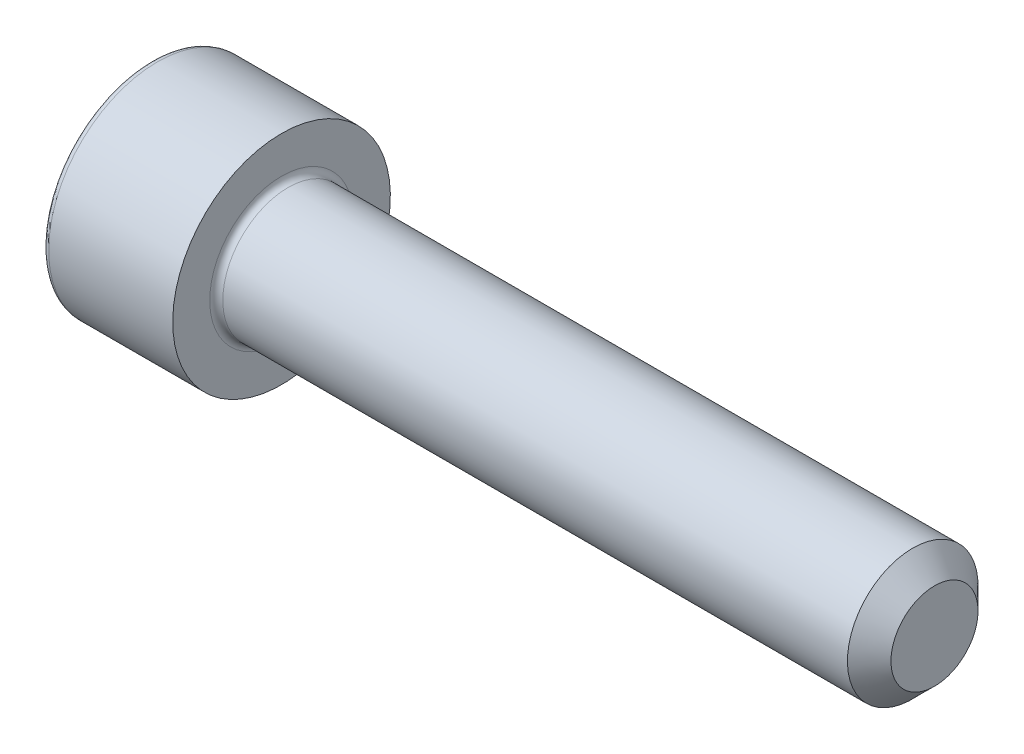
ISO-10303-21;
HEADER;
FILE_DESCRIPTION(('STEP AP214'),'2;1');
FILE_NAME('part.step','',(''),(''),'','','');
FILE_SCHEMA(('AUTOMOTIVE_DESIGN { 1 0 10303 214 1 1 1 1 }'));
ENDSEC;
DATA;
#1=APPLICATION_CONTEXT('core data for automotive mechanical design processes');
#2=APPLICATION_PROTOCOL_DEFINITION('international standard','automotive_design',2000,#1);
#3=PRODUCT_CONTEXT('',#1,'mechanical');
#4=PRODUCT('Part','Part','',(#3));
#5=PRODUCT_RELATED_PRODUCT_CATEGORY('part','',(#4));
#6=PRODUCT_DEFINITION_FORMATION('','',#4);
#7=PRODUCT_DEFINITION_CONTEXT('part definition',#1,'design');
#8=PRODUCT_DEFINITION('design','',#6,#7);
#9=PRODUCT_DEFINITION_SHAPE('','',#8);
#10=(LENGTH_UNIT() NAMED_UNIT(*) SI_UNIT(.MILLI.,.METRE.));
#11=(NAMED_UNIT(*) PLANE_ANGLE_UNIT() SI_UNIT($,.RADIAN.));
#12=(NAMED_UNIT(*) SI_UNIT($,.STERADIAN.) SOLID_ANGLE_UNIT());
#13=UNCERTAINTY_MEASURE_WITH_UNIT(LENGTH_MEASURE(1.E-05),#10,'distance_accuracy_value','');
#14=(GEOMETRIC_REPRESENTATION_CONTEXT(3) GLOBAL_UNCERTAINTY_ASSIGNED_CONTEXT((#13)) GLOBAL_UNIT_ASSIGNED_CONTEXT((#10,
#11,#12)) REPRESENTATION_CONTEXT('',''));
#15=CARTESIAN_POINT('',(0.,0.,0.));
#16=DIRECTION('',(0.,0.,1.));
#17=DIRECTION('',(1.,0.,0.));
#18=AXIS2_PLACEMENT_3D('',#15,#16,#17);
#19=CARTESIAN_POINT('',(0.,0.,0.));
#20=DIRECTION('',(-1.,0.,0.));
#21=DIRECTION('',(0.,-1.,0.));
#22=AXIS2_PLACEMENT_3D('',#19,#20,#21);
#23=PLANE('',#22);
#24=CARTESIAN_POINT('',(0.,0.,0.));
#25=DIRECTION('',(-1.,0.,0.));
#26=DIRECTION('',(0.,-1.,0.));
#27=AXIS2_PLACEMENT_3D('',#24,#25,#26);
#28=CIRCLE('',#27,4.7);
#29=CARTESIAN_POINT('',(0.,-4.7,0.));
#30=VERTEX_POINT('',#29);
#31=EDGE_CURVE('E158',#30,#30,#28,.T.);
#32=ORIENTED_EDGE('',*,*,#31,.T.);
#33=EDGE_LOOP('',(#32));
#34=FACE_BOUND('',#33,.T.);
#35=DIRECTION('',(0.,0.,-1.));
#36=VECTOR('',#35,1.);
#37=CARTESIAN_POINT('',(0.,2.5,1.44337567297407));
#38=LINE('',#37,#36);
#39=CARTESIAN_POINT('',(0.,2.5,1.44337567297407));
#40=VERTEX_POINT('',#39);
#41=CARTESIAN_POINT('',(0.,2.5,-1.44337567297406));
#42=VERTEX_POINT('',#41);
#43=EDGE_CURVE('E54',#40,#42,#38,.T.);
#44=ORIENTED_EDGE('',*,*,#43,.F.);
#45=DIRECTION('',(0.,0.866025403784439,-0.5));
#46=VECTOR('',#45,1.);
#47=CARTESIAN_POINT('',(0.,0.,2.88675134594813));
#48=LINE('',#47,#46);
#49=CARTESIAN_POINT('',(0.,0.,2.88675134594813));
#50=VERTEX_POINT('',#49);
#51=EDGE_CURVE('E137',#50,#40,#48,.T.);
#52=ORIENTED_EDGE('',*,*,#51,.F.);
#53=DIRECTION('',(0.,0.866025403784439,0.5));
#54=VECTOR('',#53,1.);
#55=CARTESIAN_POINT('',(0.,-2.5,1.44337567297406));
#56=LINE('',#55,#54);
#57=CARTESIAN_POINT('',(0.,-2.5,1.44337567297406));
#58=VERTEX_POINT('',#57);
#59=EDGE_CURVE('E135',#58,#50,#56,.T.);
#60=ORIENTED_EDGE('',*,*,#59,.F.);
#61=DIRECTION('',(0.,0.,1.));
#62=VECTOR('',#61,1.);
#63=CARTESIAN_POINT('',(0.,-2.5,-1.44337567297407));
#64=LINE('',#63,#62);
#65=CARTESIAN_POINT('',(0.,-2.5,-1.44337567297407));
#66=VERTEX_POINT('',#65);
#67=EDGE_CURVE('E102',#66,#58,#64,.T.);
#68=ORIENTED_EDGE('',*,*,#67,.F.);
#69=DIRECTION('',(0.,-0.866025403784439,0.5));
#70=VECTOR('',#69,1.);
#71=CARTESIAN_POINT('',(0.,0.,-2.88675134594813));
#72=LINE('',#71,#70);
#73=CARTESIAN_POINT('',(0.,0.,-2.88675134594813));
#74=VERTEX_POINT('',#73);
#75=EDGE_CURVE('E131',#74,#66,#72,.T.);
#76=ORIENTED_EDGE('',*,*,#75,.F.);
#77=DIRECTION('',(0.,-0.866025403784439,-0.5));
#78=VECTOR('',#77,1.);
#79=CARTESIAN_POINT('',(0.,2.5,-1.44337567297406));
#80=LINE('',#79,#78);
#81=EDGE_CURVE('E128',#42,#74,#80,.T.);
#82=ORIENTED_EDGE('',*,*,#81,.F.);
#83=EDGE_LOOP('',(#44,#52,#60,#68,#76,#82));
#84=FACE_BOUND('',#83,.T.);
#85=ADVANCED_FACE('F38',(#34,#84),#23,.T.);
#86=CARTESIAN_POINT('',(36.,0.,0.));
#87=DIRECTION('',(1.,0.,0.));
#88=DIRECTION('',(0.,1.,0.));
#89=AXIS2_PLACEMENT_3D('',#86,#87,#88);
#90=CYLINDRICAL_SURFACE('',#89,5.);
#91=CARTESIAN_POINT('',(0.300000000000002,0.,0.));
#92=DIRECTION('',(-1.,0.,0.));
#93=DIRECTION('',(0.,-1.,0.));
#94=AXIS2_PLACEMENT_3D('',#91,#92,#93);
#95=CIRCLE('',#94,5.);
#96=CARTESIAN_POINT('',(0.300000000000002,-5.,0.));
#97=VERTEX_POINT('',#96);
#98=EDGE_CURVE('E155',#97,#97,#95,.F.);
#99=ORIENTED_EDGE('',*,*,#98,.T.);
#100=EDGE_LOOP('',(#99));
#101=FACE_BOUND('',#100,.T.);
#102=CARTESIAN_POINT('',(6.,0.,0.));
#103=DIRECTION('',(1.,0.,0.));
#104=DIRECTION('',(0.,1.,0.));
#105=AXIS2_PLACEMENT_3D('',#102,#103,#104);
#106=CIRCLE('',#105,5.);
#107=CARTESIAN_POINT('',(6.,5.,0.));
#108=VERTEX_POINT('',#107);
#109=EDGE_CURVE('E141',#108,#108,#106,.T.);
#110=ORIENTED_EDGE('',*,*,#109,.F.);
#111=EDGE_LOOP('',(#110));
#112=FACE_BOUND('',#111,.T.);
#113=ADVANCED_FACE('F175',(#101,#112),#90,.T.);
#114=CARTESIAN_POINT('',(6.,5.,0.));
#115=DIRECTION('',(1.,0.,0.));
#116=DIRECTION('',(0.,1.,0.));
#117=AXIS2_PLACEMENT_3D('',#114,#115,#116);
#118=PLANE('',#117);
#119=CARTESIAN_POINT('',(6.,0.,0.));
#120=DIRECTION('',(1.,0.,0.));
#121=DIRECTION('',(0.,1.,0.));
#122=AXIS2_PLACEMENT_3D('',#119,#120,#121);
#123=CIRCLE('',#122,3.29999999999999);
#124=CARTESIAN_POINT('',(6.,3.29999999999999,0.));
#125=VERTEX_POINT('',#124);
#126=EDGE_CURVE('E152',#125,#125,#123,.F.);
#127=ORIENTED_EDGE('',*,*,#126,.T.);
#128=EDGE_LOOP('',(#127));
#129=FACE_BOUND('',#128,.T.);
#130=ORIENTED_EDGE('',*,*,#109,.T.);
#131=EDGE_LOOP('',(#130));
#132=FACE_BOUND('',#131,.T.);
#133=ADVANCED_FACE('F181',(#129,#132),#118,.T.);
#134=CARTESIAN_POINT('',(36.,0.,0.));
#135=DIRECTION('',(1.,0.,0.));
#136=DIRECTION('',(0.,1.,0.));
#137=AXIS2_PLACEMENT_3D('',#134,#135,#136);
#138=CYLINDRICAL_SURFACE('',#137,2.99999999999999);
#139=CARTESIAN_POINT('',(35.,0.,0.));
#140=DIRECTION('',(1.,0.,0.));
#141=DIRECTION('',(0.,1.,0.));
#142=AXIS2_PLACEMENT_3D('',#139,#140,#141);
#143=CIRCLE('',#142,2.99999999999999);
#144=CARTESIAN_POINT('',(35.,3.,0.));
#145=VERTEX_POINT('',#144);
#146=EDGE_CURVE('E11',#145,#145,#143,.F.);
#147=ORIENTED_EDGE('',*,*,#146,.T.);
#148=EDGE_LOOP('',(#147));
#149=FACE_BOUND('',#148,.T.);
#150=CARTESIAN_POINT('',(6.3,0.,0.));
#151=DIRECTION('',(1.,0.,0.));
#152=DIRECTION('',(0.,1.,0.));
#153=AXIS2_PLACEMENT_3D('',#150,#151,#152);
#154=CIRCLE('',#153,2.99999999999999);
#155=CARTESIAN_POINT('',(6.3,2.99999999999999,0.));
#156=VERTEX_POINT('',#155);
#157=EDGE_CURVE('E149',#156,#156,#154,.T.);
#158=ORIENTED_EDGE('',*,*,#157,.T.);
#159=EDGE_LOOP('',(#158));
#160=FACE_BOUND('',#159,.T.);
#161=ADVANCED_FACE('F198',(#149,#160),#138,.T.);
#162=CARTESIAN_POINT('',(36.,3.,0.));
#163=DIRECTION('',(1.,0.,0.));
#164=DIRECTION('',(0.,1.,0.));
#165=AXIS2_PLACEMENT_3D('',#162,#163,#164);
#166=PLANE('',#165);
#167=CARTESIAN_POINT('',(36.,0.,0.));
#168=DIRECTION('',(1.,0.,0.));
#169=DIRECTION('',(0.,1.,0.));
#170=AXIS2_PLACEMENT_3D('',#167,#168,#169);
#171=CIRCLE('',#170,2.);
#172=CARTESIAN_POINT('',(36.,2.,0.));
#173=VERTEX_POINT('',#172);
#174=EDGE_CURVE('E47',#173,#173,#171,.T.);
#175=ORIENTED_EDGE('',*,*,#174,.T.);
#176=EDGE_LOOP('',(#175));
#177=FACE_BOUND('',#176,.T.);
#178=ADVANCED_FACE('F163',(#177),#166,.T.);
#179=CARTESIAN_POINT('',(2.5,2.5,1.44337567297407));
#180=DIRECTION('',(0.,1.,0.));
#181=DIRECTION('',(-1.,0.,0.));
#182=AXIS2_PLACEMENT_3D('',#179,#180,#181);
#183=PLANE('',#182);
#184=ORIENTED_EDGE('',*,*,#43,.T.);
#185=DIRECTION('',(-1.,0.,0.));
#186=VECTOR('',#185,1.);
#187=CARTESIAN_POINT('',(2.5,2.5,-1.44337567297406));
#188=LINE('',#187,#186);
#189=CARTESIAN_POINT('',(2.5,2.5,-1.44337567297406));
#190=VERTEX_POINT('',#189);
#191=EDGE_CURVE('E84',#190,#42,#188,.T.);
#192=ORIENTED_EDGE('',*,*,#191,.F.);
#193=DIRECTION('',(0.,0.,-1.));
#194=VECTOR('',#193,1.);
#195=CARTESIAN_POINT('',(2.5,2.5,1.44337567297407));
#196=LINE('',#195,#194);
#197=CARTESIAN_POINT('',(2.5,2.5,1.44337567297407));
#198=VERTEX_POINT('',#197);
#199=EDGE_CURVE('E139',#198,#190,#196,.T.);
#200=ORIENTED_EDGE('',*,*,#199,.F.);
#201=DIRECTION('',(-1.,0.,0.));
#202=VECTOR('',#201,1.);
#203=CARTESIAN_POINT('',(2.5,2.5,1.44337567297407));
#204=LINE('',#203,#202);
#205=EDGE_CURVE('E62',#198,#40,#204,.T.);
#206=ORIENTED_EDGE('',*,*,#205,.T.);
#207=EDGE_LOOP('',(#184,#192,#200,#206));
#208=FACE_BOUND('',#207,.T.);
#209=ADVANCED_FACE('F206',(#208),#183,.F.);
#210=CARTESIAN_POINT('',(2.5,0.,2.88675134594813));
#211=DIRECTION('',(0.,0.5,0.866025403784439));
#212=DIRECTION('',(0.,-0.866025403784439,0.5));
#213=AXIS2_PLACEMENT_3D('',#210,#211,#212);
#214=PLANE('',#213);
#215=ORIENTED_EDGE('',*,*,#51,.T.);
#216=ORIENTED_EDGE('',*,*,#205,.F.);
#217=DIRECTION('',(0.,0.866025403784439,-0.5));
#218=VECTOR('',#217,1.);
#219=CARTESIAN_POINT('',(2.5,0.,2.88675134594813));
#220=LINE('',#219,#218);
#221=CARTESIAN_POINT('',(2.5,0.,2.88675134594813));
#222=VERTEX_POINT('',#221);
#223=EDGE_CURVE('E114',#222,#198,#220,.T.);
#224=ORIENTED_EDGE('',*,*,#223,.F.);
#225=DIRECTION('',(-1.,0.,0.));
#226=VECTOR('',#225,1.);
#227=CARTESIAN_POINT('',(2.5,0.,2.88675134594813));
#228=LINE('',#227,#226);
#229=EDGE_CURVE('E106',#222,#50,#228,.T.);
#230=ORIENTED_EDGE('',*,*,#229,.T.);
#231=EDGE_LOOP('',(#215,#216,#224,#230));
#232=FACE_BOUND('',#231,.T.);
#233=ADVANCED_FACE('F212',(#232),#214,.F.);
#234=CARTESIAN_POINT('',(2.5,-2.5,1.44337567297406));
#235=DIRECTION('',(0.,-0.5,0.866025403784439));
#236=DIRECTION('',(0.,-0.866025403784439,-0.5));
#237=AXIS2_PLACEMENT_3D('',#234,#235,#236);
#238=PLANE('',#237);
#239=ORIENTED_EDGE('',*,*,#59,.T.);
#240=ORIENTED_EDGE('',*,*,#229,.F.);
#241=DIRECTION('',(0.,0.866025403784439,0.5));
#242=VECTOR('',#241,1.);
#243=CARTESIAN_POINT('',(2.5,-2.5,1.44337567297406));
#244=LINE('',#243,#242);
#245=CARTESIAN_POINT('',(2.5,-2.5,1.44337567297406));
#246=VERTEX_POINT('',#245);
#247=EDGE_CURVE('E110',#246,#222,#244,.T.);
#248=ORIENTED_EDGE('',*,*,#247,.F.);
#249=DIRECTION('',(-1.,0.,0.));
#250=VECTOR('',#249,1.);
#251=CARTESIAN_POINT('',(2.5,-2.5,1.44337567297406));
#252=LINE('',#251,#250);
#253=EDGE_CURVE('E95',#246,#58,#252,.T.);
#254=ORIENTED_EDGE('',*,*,#253,.T.);
#255=EDGE_LOOP('',(#239,#240,#248,#254));
#256=FACE_BOUND('',#255,.T.);
#257=ADVANCED_FACE('F111',(#256),#238,.F.);
#258=CARTESIAN_POINT('',(2.5,-2.5,-1.44337567297407));
#259=DIRECTION('',(0.,-1.,0.));
#260=DIRECTION('',(1.,0.,0.));
#261=AXIS2_PLACEMENT_3D('',#258,#259,#260);
#262=PLANE('',#261);
#263=ORIENTED_EDGE('',*,*,#67,.T.);
#264=ORIENTED_EDGE('',*,*,#253,.F.);
#265=DIRECTION('',(0.,0.,1.));
#266=VECTOR('',#265,1.);
#267=CARTESIAN_POINT('',(2.5,-2.5,-1.44337567297407));
#268=LINE('',#267,#266);
#269=CARTESIAN_POINT('',(2.5,-2.5,-1.44337567297407));
#270=VERTEX_POINT('',#269);
#271=EDGE_CURVE('E99',#270,#246,#268,.T.);
#272=ORIENTED_EDGE('',*,*,#271,.F.);
#273=DIRECTION('',(-1.,0.,0.));
#274=VECTOR('',#273,1.);
#275=CARTESIAN_POINT('',(2.5,-2.5,-1.44337567297407));
#276=LINE('',#275,#274);
#277=EDGE_CURVE('E107',#270,#66,#276,.T.);
#278=ORIENTED_EDGE('',*,*,#277,.T.);
#279=EDGE_LOOP('',(#263,#264,#272,#278));
#280=FACE_BOUND('',#279,.T.);
#281=ADVANCED_FACE('F97',(#280),#262,.F.);
#282=CARTESIAN_POINT('',(2.5,0.,-2.88675134594813));
#283=DIRECTION('',(0.,-0.5,-0.866025403784439));
#284=DIRECTION('',(0.,0.866025403784439,-0.5));
#285=AXIS2_PLACEMENT_3D('',#282,#283,#284);
#286=PLANE('',#285);
#287=ORIENTED_EDGE('',*,*,#75,.T.);
#288=ORIENTED_EDGE('',*,*,#277,.F.);
#289=DIRECTION('',(0.,-0.866025403784439,0.5));
#290=VECTOR('',#289,1.);
#291=CARTESIAN_POINT('',(2.5,0.,-2.88675134594813));
#292=LINE('',#291,#290);
#293=CARTESIAN_POINT('',(2.5,0.,-2.88675134594813));
#294=VERTEX_POINT('',#293);
#295=EDGE_CURVE('E120',#294,#270,#292,.T.);
#296=ORIENTED_EDGE('',*,*,#295,.F.);
#297=DIRECTION('',(-1.,0.,0.));
#298=VECTOR('',#297,1.);
#299=CARTESIAN_POINT('',(2.5,0.,-2.88675134594813));
#300=LINE('',#299,#298);
#301=EDGE_CURVE('E144',#294,#74,#300,.T.);
#302=ORIENTED_EDGE('',*,*,#301,.T.);
#303=EDGE_LOOP('',(#287,#288,#296,#302));
#304=FACE_BOUND('',#303,.T.);
#305=ADVANCED_FACE('F215',(#304),#286,.F.);
#306=CARTESIAN_POINT('',(2.5,2.5,-1.44337567297406));
#307=DIRECTION('',(0.,0.5,-0.866025403784439));
#308=DIRECTION('',(0.,0.866025403784439,0.5));
#309=AXIS2_PLACEMENT_3D('',#306,#307,#308);
#310=PLANE('',#309);
#311=ORIENTED_EDGE('',*,*,#81,.T.);
#312=ORIENTED_EDGE('',*,*,#301,.F.);
#313=DIRECTION('',(0.,-0.866025403784439,-0.5));
#314=VECTOR('',#313,1.);
#315=CARTESIAN_POINT('',(2.5,2.5,-1.44337567297406));
#316=LINE('',#315,#314);
#317=EDGE_CURVE('E122',#190,#294,#316,.T.);
#318=ORIENTED_EDGE('',*,*,#317,.F.);
#319=ORIENTED_EDGE('',*,*,#191,.T.);
#320=EDGE_LOOP('',(#311,#312,#318,#319));
#321=FACE_BOUND('',#320,.T.);
#322=ADVANCED_FACE('F192',(#321),#310,.F.);
#323=CARTESIAN_POINT('',(2.5,0.,0.));
#324=DIRECTION('',(-1.,0.,0.));
#325=DIRECTION('',(0.,-1.,0.));
#326=AXIS2_PLACEMENT_3D('',#323,#324,#325);
#327=PLANE('',#326);
#328=ORIENTED_EDGE('',*,*,#199,.T.);
#329=ORIENTED_EDGE('',*,*,#317,.T.);
#330=ORIENTED_EDGE('',*,*,#295,.T.);
#331=ORIENTED_EDGE('',*,*,#271,.T.);
#332=ORIENTED_EDGE('',*,*,#247,.T.);
#333=ORIENTED_EDGE('',*,*,#223,.T.);
#334=EDGE_LOOP('',(#328,#329,#330,#331,#332,#333));
#335=FACE_BOUND('',#334,.T.);
#336=ADVANCED_FACE('F117',(#335),#327,.T.);
#337=CARTESIAN_POINT('',(6.3,0.,0.));
#338=DIRECTION('',(1.,0.,0.));
#339=DIRECTION('',(0.,1.,0.));
#340=AXIS2_PLACEMENT_3D('',#337,#338,#339);
#341=TOROIDAL_SURFACE('',#340,3.29999999999999,0.3);
#342=ORIENTED_EDGE('',*,*,#126,.F.);
#343=EDGE_LOOP('',(#342));
#344=FACE_BOUND('',#343,.T.);
#345=ORIENTED_EDGE('',*,*,#157,.F.);
#346=EDGE_LOOP('',(#345));
#347=FACE_BOUND('',#346,.T.);
#348=ADVANCED_FACE('F171',(#344,#347),#341,.F.);
#349=CARTESIAN_POINT('',(0.300000000000002,0.,0.));
#350=DIRECTION('',(-1.,0.,0.));
#351=DIRECTION('',(0.,-1.,0.));
#352=AXIS2_PLACEMENT_3D('',#349,#350,#351);
#353=TOROIDAL_SURFACE('',#352,4.7,0.3);
#354=ORIENTED_EDGE('',*,*,#31,.F.);
#355=EDGE_LOOP('',(#354));
#356=FACE_BOUND('',#355,.T.);
#357=ORIENTED_EDGE('',*,*,#98,.F.);
#358=EDGE_LOOP('',(#357));
#359=FACE_BOUND('',#358,.T.);
#360=ADVANCED_FACE('F166',(#356,#359),#353,.T.);
#361=CARTESIAN_POINT('',(36.,0.,0.));
#362=DIRECTION('',(-1.,0.,0.));
#363=DIRECTION('',(0.,-1.,0.));
#364=AXIS2_PLACEMENT_3D('',#361,#362,#363);
#365=CONICAL_SURFACE('',#364,2.,0.785398163397453);
#366=ORIENTED_EDGE('',*,*,#146,.F.);
#367=EDGE_LOOP('',(#366));
#368=FACE_BOUND('',#367,.T.);
#369=ORIENTED_EDGE('',*,*,#174,.F.);
#370=EDGE_LOOP('',(#369));
#371=FACE_BOUND('',#370,.T.);
#372=ADVANCED_FACE('F41',(#368,#371),#365,.T.);
#373=CLOSED_SHELL('',(#85,#113,#133,#161,#178,#209,#233,#257,#281,#305,#322,#336,#348,#360,#372));
#374=MANIFOLD_SOLID_BREP('B2',#373);
#375=ADVANCED_BREP_SHAPE_REPRESENTATION('',(#18,#374),#14);
#376=SHAPE_DEFINITION_REPRESENTATION(#9,#375);
ENDSEC;
END-ISO-10303-21;
